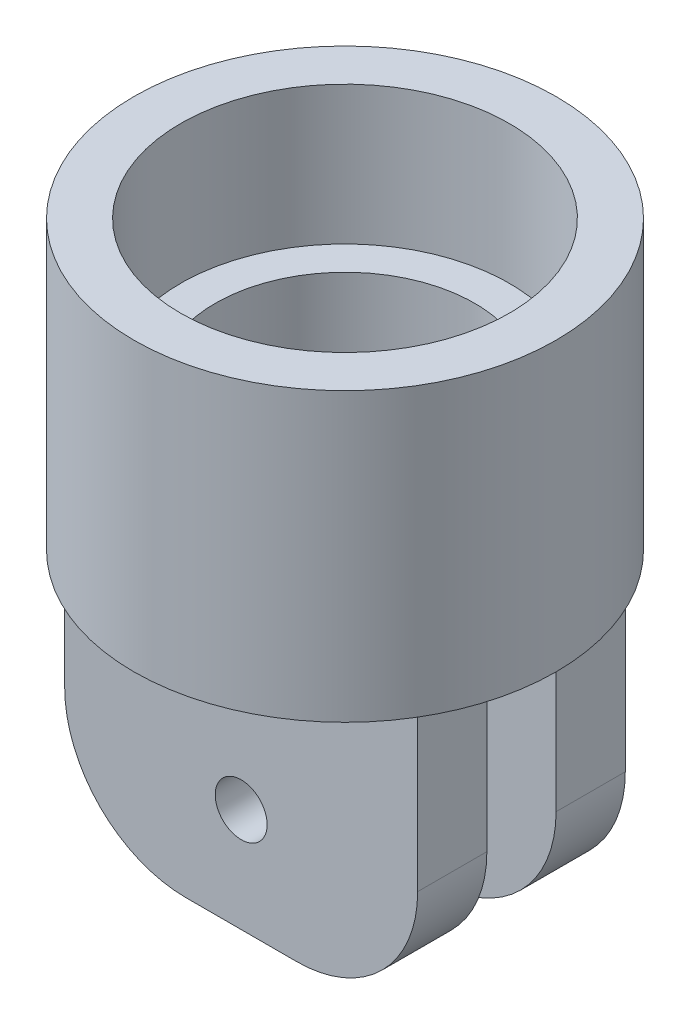
ISO-10303-21;
HEADER;
FILE_DESCRIPTION(('STEP AP214'),'2;1');
FILE_NAME('part.step','',(''),(''),'','','');
FILE_SCHEMA(('AUTOMOTIVE_DESIGN { 1 0 10303 214 1 1 1 1 }'));
ENDSEC;
DATA;
#1=APPLICATION_CONTEXT('core data for automotive mechanical design processes');
#2=APPLICATION_PROTOCOL_DEFINITION('international standard','automotive_design',2000,#1);
#3=PRODUCT_CONTEXT('',#1,'mechanical');
#4=PRODUCT('Part','Part','',(#3));
#5=PRODUCT_RELATED_PRODUCT_CATEGORY('part','',(#4));
#6=PRODUCT_DEFINITION_FORMATION('','',#4);
#7=PRODUCT_DEFINITION_CONTEXT('part definition',#1,'design');
#8=PRODUCT_DEFINITION('design','',#6,#7);
#9=PRODUCT_DEFINITION_SHAPE('','',#8);
#10=(LENGTH_UNIT() NAMED_UNIT(*) SI_UNIT(.MILLI.,.METRE.));
#11=(NAMED_UNIT(*) PLANE_ANGLE_UNIT() SI_UNIT($,.RADIAN.));
#12=(NAMED_UNIT(*) SI_UNIT($,.STERADIAN.) SOLID_ANGLE_UNIT());
#13=UNCERTAINTY_MEASURE_WITH_UNIT(LENGTH_MEASURE(1.E-05),#10,'distance_accuracy_value','');
#14=(GEOMETRIC_REPRESENTATION_CONTEXT(3) GLOBAL_UNCERTAINTY_ASSIGNED_CONTEXT((#13)) GLOBAL_UNIT_ASSIGNED_CONTEXT((#10,
#11,#12)) REPRESENTATION_CONTEXT('',''));
#15=CARTESIAN_POINT('',(0.,0.,0.));
#16=DIRECTION('',(0.,0.,1.));
#17=DIRECTION('',(1.,0.,0.));
#18=AXIS2_PLACEMENT_3D('',#15,#16,#17);
#19=CARTESIAN_POINT('',(-5.1,0.,3.));
#20=DIRECTION('',(0.,-1.,0.));
#21=DIRECTION('',(0.,0.,-1.));
#22=AXIS2_PLACEMENT_3D('',#19,#20,#21);
#23=PLANE('',#22);
#24=CARTESIAN_POINT('',(0.,0.,0.));
#25=DIRECTION('',(0.,1.,0.));
#26=DIRECTION('',(0.,0.,1.));
#27=AXIS2_PLACEMENT_3D('',#24,#25,#26);
#28=CIRCLE('',#27,1.5);
#29=CARTESIAN_POINT('',(-1.1180339887499,0.,1.));
#30=VERTEX_POINT('',#29);
#31=CARTESIAN_POINT('',(1.1180339887499,0.,1.));
#32=VERTEX_POINT('',#31);
#33=EDGE_CURVE('E162',#30,#32,#28,.T.);
#34=ORIENTED_EDGE('',*,*,#33,.T.);
#35=DIRECTION('',(-1.,0.,0.));
#36=VECTOR('',#35,1.);
#37=CARTESIAN_POINT('',(-7.62868564007539,0.,1.));
#38=LINE('',#37,#36);
#39=EDGE_CURVE('E142',#32,#30,#38,.T.);
#40=ORIENTED_EDGE('',*,*,#39,.T.);
#41=EDGE_LOOP('',(#34,#40));
#42=FACE_BOUND('',#41,.T.);
#43=ADVANCED_FACE('F39',(#42),#23,.F.);
#44=CARTESIAN_POINT('',(-5.1,0.,3.));
#45=DIRECTION('',(1.,0.,0.));
#46=DIRECTION('',(0.,1.,0.));
#47=AXIS2_PLACEMENT_3D('',#44,#45,#46);
#48=PLANE('',#47);
#49=DIRECTION('',(0.,0.,-1.));
#50=VECTOR('',#49,1.);
#51=CARTESIAN_POINT('',(-5.1,-4.49999999999998,3.));
#52=LINE('',#51,#50);
#53=CARTESIAN_POINT('',(-5.1,-4.5,-1.));
#54=VERTEX_POINT('',#53);
#55=CARTESIAN_POINT('',(-5.1,-4.49999999999998,-3.));
#56=VERTEX_POINT('',#55);
#57=EDGE_CURVE('E273',#54,#56,#52,.T.);
#58=ORIENTED_EDGE('',*,*,#57,.F.);
#59=DIRECTION('',(0.,1.,0.));
#60=VECTOR('',#59,1.);
#61=CARTESIAN_POINT('',(-5.1,0.,-1.));
#62=LINE('',#61,#60);
#63=CARTESIAN_POINT('',(-5.1,0.,-1.));
#64=VERTEX_POINT('',#63);
#65=EDGE_CURVE('E183',#54,#64,#62,.T.);
#66=ORIENTED_EDGE('',*,*,#65,.T.);
#67=DIRECTION('',(0.,0.,-1.));
#68=VECTOR('',#67,1.);
#69=CARTESIAN_POINT('',(-5.1,0.,3.));
#70=LINE('',#69,#68);
#71=CARTESIAN_POINT('',(-5.1,0.,-3.));
#72=VERTEX_POINT('',#71);
#73=EDGE_CURVE('E228',#64,#72,#70,.T.);
#74=ORIENTED_EDGE('',*,*,#73,.T.);
#75=DIRECTION('',(0.,-1.,0.));
#76=VECTOR('',#75,1.);
#77=CARTESIAN_POINT('',(-5.1,0.,-3.));
#78=LINE('',#77,#76);
#79=EDGE_CURVE('E204',#72,#56,#78,.T.);
#80=ORIENTED_EDGE('',*,*,#79,.T.);
#81=EDGE_LOOP('',(#58,#66,#74,#80));
#82=FACE_BOUND('',#81,.T.);
#83=ADVANCED_FACE('F310',(#82),#48,.F.);
#84=CARTESIAN_POINT('',(-1.6,-4.5,3.));
#85=DIRECTION('',(0.,0.,-1.));
#86=DIRECTION('',(-1.,0.,0.));
#87=AXIS2_PLACEMENT_3D('',#84,#85,#86);
#88=CYLINDRICAL_SURFACE('',#87,3.5);
#89=DIRECTION('',(0.,0.,-1.));
#90=VECTOR('',#89,1.);
#91=CARTESIAN_POINT('',(-1.59999999999997,-8.,3.));
#92=LINE('',#91,#90);
#93=CARTESIAN_POINT('',(-1.59999999999997,-8.,-1.));
#94=VERTEX_POINT('',#93);
#95=CARTESIAN_POINT('',(-1.59999999999997,-8.,-3.));
#96=VERTEX_POINT('',#95);
#97=EDGE_CURVE('E268',#94,#96,#92,.T.);
#98=ORIENTED_EDGE('',*,*,#97,.F.);
#99=CARTESIAN_POINT('',(-1.6,-4.5,-1.));
#100=DIRECTION('',(0.,0.,-1.));
#101=DIRECTION('',(-1.,0.,0.));
#102=AXIS2_PLACEMENT_3D('',#99,#100,#101);
#103=CIRCLE('',#102,3.5);
#104=EDGE_CURVE('E191',#94,#54,#103,.T.);
#105=ORIENTED_EDGE('',*,*,#104,.T.);
#106=ORIENTED_EDGE('',*,*,#57,.T.);
#107=CARTESIAN_POINT('',(-1.6,-4.5,-3.));
#108=DIRECTION('',(0.,0.,1.));
#109=DIRECTION('',(1.,0.,0.));
#110=AXIS2_PLACEMENT_3D('',#107,#108,#109);
#111=CIRCLE('',#110,3.5);
#112=EDGE_CURVE('E232',#56,#96,#111,.T.);
#113=ORIENTED_EDGE('',*,*,#112,.T.);
#114=EDGE_LOOP('',(#98,#105,#106,#113));
#115=FACE_BOUND('',#114,.T.);
#116=ADVANCED_FACE('F317',(#115),#88,.T.);
#117=CARTESIAN_POINT('',(-1.59999999999997,-8.,3.));
#118=DIRECTION('',(0.,1.,0.));
#119=DIRECTION('',(0.,0.,1.));
#120=AXIS2_PLACEMENT_3D('',#117,#118,#119);
#121=PLANE('',#120);
#122=DIRECTION('',(0.,0.,-1.));
#123=VECTOR('',#122,1.);
#124=CARTESIAN_POINT('',(1.59999999999998,-8.,3.));
#125=LINE('',#124,#123);
#126=CARTESIAN_POINT('',(1.6,-8.,-1.));
#127=VERTEX_POINT('',#126);
#128=CARTESIAN_POINT('',(1.59999999999998,-8.,-3.));
#129=VERTEX_POINT('',#128);
#130=EDGE_CURVE('E263',#127,#129,#125,.T.);
#131=ORIENTED_EDGE('',*,*,#130,.F.);
#132=DIRECTION('',(1.,0.,0.));
#133=VECTOR('',#132,1.);
#134=CARTESIAN_POINT('',(-7.62868564007539,-8.,-1.));
#135=LINE('',#134,#133);
#136=EDGE_CURVE('E342',#94,#127,#135,.T.);
#137=ORIENTED_EDGE('',*,*,#136,.F.);
#138=ORIENTED_EDGE('',*,*,#97,.T.);
#139=DIRECTION('',(1.,0.,0.));
#140=VECTOR('',#139,1.);
#141=CARTESIAN_POINT('',(-1.59999999999997,-8.,-3.));
#142=LINE('',#141,#140);
#143=EDGE_CURVE('E236',#96,#129,#142,.T.);
#144=ORIENTED_EDGE('',*,*,#143,.T.);
#145=EDGE_LOOP('',(#131,#137,#138,#144));
#146=FACE_BOUND('',#145,.T.);
#147=ADVANCED_FACE('F372',(#146),#121,.F.);
#148=CARTESIAN_POINT('',(1.6,-4.5,3.));
#149=DIRECTION('',(0.,0.,-1.));
#150=DIRECTION('',(-1.,0.,0.));
#151=AXIS2_PLACEMENT_3D('',#148,#149,#150);
#152=CYLINDRICAL_SURFACE('',#151,3.5);
#153=DIRECTION('',(0.,0.,-1.));
#154=VECTOR('',#153,1.);
#155=CARTESIAN_POINT('',(5.1,-4.49999999999998,3.));
#156=LINE('',#155,#154);
#157=CARTESIAN_POINT('',(5.1,-4.49999999999998,-1.));
#158=VERTEX_POINT('',#157);
#159=CARTESIAN_POINT('',(5.1,-4.49999999999998,-3.));
#160=VERTEX_POINT('',#159);
#161=EDGE_CURVE('E258',#158,#160,#156,.T.);
#162=ORIENTED_EDGE('',*,*,#161,.F.);
#163=CARTESIAN_POINT('',(1.6,-4.5,-1.));
#164=DIRECTION('',(0.,0.,-1.));
#165=DIRECTION('',(-1.,0.,0.));
#166=AXIS2_PLACEMENT_3D('',#163,#164,#165);
#167=CIRCLE('',#166,3.5);
#168=EDGE_CURVE('E198',#158,#127,#167,.T.);
#169=ORIENTED_EDGE('',*,*,#168,.T.);
#170=ORIENTED_EDGE('',*,*,#130,.T.);
#171=CARTESIAN_POINT('',(1.6,-4.5,-3.));
#172=DIRECTION('',(0.,0.,1.));
#173=DIRECTION('',(1.,0.,0.));
#174=AXIS2_PLACEMENT_3D('',#171,#172,#173);
#175=CIRCLE('',#174,3.5);
#176=EDGE_CURVE('E240',#129,#160,#175,.T.);
#177=ORIENTED_EDGE('',*,*,#176,.T.);
#178=EDGE_LOOP('',(#162,#169,#170,#177));
#179=FACE_BOUND('',#178,.T.);
#180=ADVANCED_FACE('F369',(#179),#152,.T.);
#181=CARTESIAN_POINT('',(5.1,0.,3.));
#182=DIRECTION('',(-1.,0.,0.));
#183=DIRECTION('',(0.,-1.,0.));
#184=AXIS2_PLACEMENT_3D('',#181,#182,#183);
#185=PLANE('',#184);
#186=DIRECTION('',(0.,0.,-1.));
#187=VECTOR('',#186,1.);
#188=CARTESIAN_POINT('',(5.1,0.,3.));
#189=LINE('',#188,#187);
#190=CARTESIAN_POINT('',(5.1,0.,-1.));
#191=VERTEX_POINT('',#190);
#192=CARTESIAN_POINT('',(5.1,0.,-3.));
#193=VERTEX_POINT('',#192);
#194=EDGE_CURVE('E255',#191,#193,#189,.T.);
#195=ORIENTED_EDGE('',*,*,#194,.F.);
#196=DIRECTION('',(0.,-1.,0.));
#197=VECTOR('',#196,1.);
#198=CARTESIAN_POINT('',(5.1,0.,-1.));
#199=LINE('',#198,#197);
#200=EDGE_CURVE('E361',#191,#158,#199,.T.);
#201=ORIENTED_EDGE('',*,*,#200,.T.);
#202=ORIENTED_EDGE('',*,*,#161,.T.);
#203=DIRECTION('',(0.,1.,0.));
#204=VECTOR('',#203,1.);
#205=CARTESIAN_POINT('',(5.1,0.,-3.));
#206=LINE('',#205,#204);
#207=EDGE_CURVE('E244',#160,#193,#206,.T.);
#208=ORIENTED_EDGE('',*,*,#207,.T.);
#209=EDGE_LOOP('',(#195,#201,#202,#208));
#210=FACE_BOUND('',#209,.T.);
#211=ADVANCED_FACE('F304',(#210),#185,.F.);
#212=CARTESIAN_POINT('',(0.,-5.,3.));
#213=DIRECTION('',(0.,0.,-1.));
#214=DIRECTION('',(-1.,0.,0.));
#215=AXIS2_PLACEMENT_3D('',#212,#213,#214);
#216=CYLINDRICAL_SURFACE('',#215,0.75);
#217=CARTESIAN_POINT('',(0.,-5.,-1.));
#218=DIRECTION('',(0.,0.,-1.));
#219=DIRECTION('',(-1.,0.,0.));
#220=AXIS2_PLACEMENT_3D('',#217,#218,#219);
#221=CIRCLE('',#220,0.75);
#222=CARTESIAN_POINT('',(-0.749999999999999,-5.,-1.));
#223=VERTEX_POINT('',#222);
#224=EDGE_CURVE('E43',#223,#223,#221,.T.);
#225=ORIENTED_EDGE('',*,*,#224,.F.);
#226=EDGE_LOOP('',(#225));
#227=FACE_BOUND('',#226,.T.);
#228=CARTESIAN_POINT('',(0.,-5.,-3.));
#229=DIRECTION('',(0.,0.,1.));
#230=DIRECTION('',(1.,0.,0.));
#231=AXIS2_PLACEMENT_3D('',#228,#229,#230);
#232=CIRCLE('',#231,0.75);
#233=CARTESIAN_POINT('',(0.750000000000001,-5.,-3.));
#234=VERTEX_POINT('',#233);
#235=EDGE_CURVE('E182',#234,#234,#232,.T.);
#236=ORIENTED_EDGE('',*,*,#235,.F.);
#237=EDGE_LOOP('',(#236));
#238=FACE_BOUND('',#237,.T.);
#239=ADVANCED_FACE('F296',(#227,#238),#216,.F.);
#240=CARTESIAN_POINT('',(0.,0.,0.));
#241=DIRECTION('',(0.,1.,0.));
#242=DIRECTION('',(0.,0.,1.));
#243=AXIS2_PLACEMENT_3D('',#240,#241,#242);
#244=PLANE('',#243);
#245=DIRECTION('',(1.,0.,0.));
#246=VECTOR('',#245,1.);
#247=CARTESIAN_POINT('',(-7.62868564007539,0.,-1.));
#248=LINE('',#247,#246);
#249=CARTESIAN_POINT('',(1.1180339887499,0.,-1.));
#250=VERTEX_POINT('',#249);
#251=EDGE_CURVE('E57',#250,#191,#248,.T.);
#252=ORIENTED_EDGE('',*,*,#251,.T.);
#253=ORIENTED_EDGE('',*,*,#194,.T.);
#254=DIRECTION('',(-1.,0.,0.));
#255=VECTOR('',#254,1.);
#256=CARTESIAN_POINT('',(-5.1,0.,-3.));
#257=LINE('',#256,#255);
#258=EDGE_CURVE('E211',#193,#72,#257,.T.);
#259=ORIENTED_EDGE('',*,*,#258,.T.);
#260=ORIENTED_EDGE('',*,*,#73,.F.);
#261=CARTESIAN_POINT('',(-1.1180339887499,0.,-1.));
#262=VERTEX_POINT('',#261);
#263=EDGE_CURVE('E336',#64,#262,#248,.T.);
#264=ORIENTED_EDGE('',*,*,#263,.T.);
#265=EDGE_CURVE('E174',#262,#30,#28,.T.);
#266=ORIENTED_EDGE('',*,*,#265,.T.);
#267=CARTESIAN_POINT('',(-5.1,0.,1.));
#268=VERTEX_POINT('',#267);
#269=EDGE_CURVE('E145',#30,#268,#38,.T.);
#270=ORIENTED_EDGE('',*,*,#269,.T.);
#271=CARTESIAN_POINT('',(-5.1,0.,3.));
#272=VERTEX_POINT('',#271);
#273=EDGE_CURVE('E251',#272,#268,#70,.T.);
#274=ORIENTED_EDGE('',*,*,#273,.F.);
#275=DIRECTION('',(-1.,0.,0.));
#276=VECTOR('',#275,1.);
#277=CARTESIAN_POINT('',(-5.1,0.,3.));
#278=LINE('',#277,#276);
#279=CARTESIAN_POINT('',(5.1,0.,3.));
#280=VERTEX_POINT('',#279);
#281=EDGE_CURVE('E224',#280,#272,#278,.T.);
#282=ORIENTED_EDGE('',*,*,#281,.F.);
#283=CARTESIAN_POINT('',(5.1,0.,1.));
#284=VERTEX_POINT('',#283);
#285=EDGE_CURVE('E159',#280,#284,#189,.T.);
#286=ORIENTED_EDGE('',*,*,#285,.T.);
#287=EDGE_CURVE('E65',#284,#32,#38,.T.);
#288=ORIENTED_EDGE('',*,*,#287,.T.);
#289=EDGE_CURVE('E156',#32,#250,#28,.T.);
#290=ORIENTED_EDGE('',*,*,#289,.T.);
#291=EDGE_LOOP('',(#252,#253,#259,#260,#264,#266,#270,#274,#282,#286,#288,#290));
#292=FACE_BOUND('',#291,.T.);
#293=CARTESIAN_POINT('',(0.,0.,0.));
#294=DIRECTION('',(0.,1.,0.));
#295=DIRECTION('',(0.,0.,1.));
#296=AXIS2_PLACEMENT_3D('',#293,#294,#295);
#297=CIRCLE('',#296,6.1);
#298=CARTESIAN_POINT('',(0.,0.,6.1));
#299=VERTEX_POINT('',#298);
#300=EDGE_CURVE('E49',#299,#299,#297,.T.);
#301=ORIENTED_EDGE('',*,*,#300,.F.);
#302=EDGE_LOOP('',(#301));
#303=FACE_BOUND('',#302,.T.);
#304=ADVANCED_FACE('F153',(#292,#303),#244,.F.);
#305=CARTESIAN_POINT('',(0.,8.3,0.));
#306=DIRECTION('',(0.,-1.,0.));
#307=DIRECTION('',(0.,0.,-1.));
#308=AXIS2_PLACEMENT_3D('',#305,#306,#307);
#309=CYLINDRICAL_SURFACE('',#308,6.1);
#310=CARTESIAN_POINT('',(0.,8.3,0.));
#311=DIRECTION('',(0.,1.,0.));
#312=DIRECTION('',(0.,0.,1.));
#313=AXIS2_PLACEMENT_3D('',#310,#311,#312);
#314=CIRCLE('',#313,6.1);
#315=CARTESIAN_POINT('',(0.,8.3,6.1));
#316=VERTEX_POINT('',#315);
#317=EDGE_CURVE('E11',#316,#316,#314,.T.);
#318=ORIENTED_EDGE('',*,*,#317,.F.);
#319=EDGE_LOOP('',(#318));
#320=FACE_BOUND('',#319,.T.);
#321=ORIENTED_EDGE('',*,*,#300,.T.);
#322=EDGE_LOOP('',(#321));
#323=FACE_BOUND('',#322,.T.);
#324=ADVANCED_FACE('F41',(#320,#323),#309,.T.);
#325=CARTESIAN_POINT('',(0.,8.3,0.));
#326=DIRECTION('',(0.,1.,0.));
#327=DIRECTION('',(0.,0.,1.));
#328=AXIS2_PLACEMENT_3D('',#325,#326,#327);
#329=PLANE('',#328);
#330=CARTESIAN_POINT('',(0.,8.3,0.));
#331=DIRECTION('',(0.,1.,0.));
#332=DIRECTION('',(0.,0.,1.));
#333=AXIS2_PLACEMENT_3D('',#330,#331,#332);
#334=CIRCLE('',#333,4.75);
#335=CARTESIAN_POINT('',(0.,8.3,4.75));
#336=VERTEX_POINT('',#335);
#337=EDGE_CURVE('E283',#336,#336,#334,.T.);
#338=ORIENTED_EDGE('',*,*,#337,.F.);
#339=EDGE_LOOP('',(#338));
#340=FACE_BOUND('',#339,.T.);
#341=ORIENTED_EDGE('',*,*,#317,.T.);
#342=EDGE_LOOP('',(#341));
#343=FACE_BOUND('',#342,.T.);
#344=ADVANCED_FACE('F302',(#340,#343),#329,.T.);
#345=CARTESIAN_POINT('',(0.,4.3,0.));
#346=DIRECTION('',(0.,1.,0.));
#347=DIRECTION('',(0.,0.,1.));
#348=AXIS2_PLACEMENT_3D('',#345,#346,#347);
#349=CYLINDRICAL_SURFACE('',#348,4.75);
#350=CARTESIAN_POINT('',(0.,4.3,0.));
#351=DIRECTION('',(0.,1.,0.));
#352=DIRECTION('',(0.,0.,1.));
#353=AXIS2_PLACEMENT_3D('',#350,#351,#352);
#354=CIRCLE('',#353,4.75);
#355=CARTESIAN_POINT('',(0.,4.3,4.75));
#356=VERTEX_POINT('',#355);
#357=EDGE_CURVE('E285',#356,#356,#354,.T.);
#358=ORIENTED_EDGE('',*,*,#357,.F.);
#359=EDGE_LOOP('',(#358));
#360=FACE_BOUND('',#359,.T.);
#361=ORIENTED_EDGE('',*,*,#337,.T.);
#362=EDGE_LOOP('',(#361));
#363=FACE_BOUND('',#362,.T.);
#364=ADVANCED_FACE('F442',(#360,#363),#349,.F.);
#365=CARTESIAN_POINT('',(0.,4.3,0.));
#366=DIRECTION('',(0.,1.,0.));
#367=DIRECTION('',(0.,0.,1.));
#368=AXIS2_PLACEMENT_3D('',#365,#366,#367);
#369=PLANE('',#368);
#370=CARTESIAN_POINT('',(0.,4.3,0.));
#371=DIRECTION('',(0.,1.,0.));
#372=DIRECTION('',(0.,0.,1.));
#373=AXIS2_PLACEMENT_3D('',#370,#371,#372);
#374=CIRCLE('',#373,3.75);
#375=CARTESIAN_POINT('',(0.,4.3,3.75));
#376=VERTEX_POINT('',#375);
#377=EDGE_CURVE('E173',#376,#376,#374,.T.);
#378=ORIENTED_EDGE('',*,*,#377,.F.);
#379=EDGE_LOOP('',(#378));
#380=FACE_BOUND('',#379,.T.);
#381=ORIENTED_EDGE('',*,*,#357,.T.);
#382=EDGE_LOOP('',(#381));
#383=FACE_BOUND('',#382,.T.);
#384=ADVANCED_FACE('F438',(#380,#383),#369,.T.);
#385=CARTESIAN_POINT('',(0.,0.8,0.));
#386=DIRECTION('',(0.,1.,0.));
#387=DIRECTION('',(0.,0.,1.));
#388=AXIS2_PLACEMENT_3D('',#385,#386,#387);
#389=CYLINDRICAL_SURFACE('',#388,3.75);
#390=CARTESIAN_POINT('',(0.,0.8,0.));
#391=DIRECTION('',(0.,1.,0.));
#392=DIRECTION('',(0.,0.,1.));
#393=AXIS2_PLACEMENT_3D('',#390,#391,#392);
#394=CIRCLE('',#393,3.75);
#395=CARTESIAN_POINT('',(0.,0.8,3.75));
#396=VERTEX_POINT('',#395);
#397=EDGE_CURVE('E178',#396,#396,#394,.T.);
#398=ORIENTED_EDGE('',*,*,#397,.F.);
#399=EDGE_LOOP('',(#398));
#400=FACE_BOUND('',#399,.T.);
#401=ORIENTED_EDGE('',*,*,#377,.T.);
#402=EDGE_LOOP('',(#401));
#403=FACE_BOUND('',#402,.T.);
#404=ADVANCED_FACE('F434',(#400,#403),#389,.F.);
#405=CARTESIAN_POINT('',(0.,0.8,0.));
#406=DIRECTION('',(0.,1.,0.));
#407=DIRECTION('',(0.,0.,1.));
#408=AXIS2_PLACEMENT_3D('',#405,#406,#407);
#409=PLANE('',#408);
#410=CARTESIAN_POINT('',(0.,0.8,0.));
#411=DIRECTION('',(0.,1.,0.));
#412=DIRECTION('',(0.,0.,1.));
#413=AXIS2_PLACEMENT_3D('',#410,#411,#412);
#414=CIRCLE('',#413,1.5);
#415=CARTESIAN_POINT('',(0.,0.8,1.5));
#416=VERTEX_POINT('',#415);
#417=EDGE_CURVE('E167',#416,#416,#414,.T.);
#418=ORIENTED_EDGE('',*,*,#417,.F.);
#419=EDGE_LOOP('',(#418));
#420=FACE_BOUND('',#419,.T.);
#421=ORIENTED_EDGE('',*,*,#397,.T.);
#422=EDGE_LOOP('',(#421));
#423=FACE_BOUND('',#422,.T.);
#424=ADVANCED_FACE('F331',(#420,#423),#409,.T.);
#425=CARTESIAN_POINT('',(0.,-3.2,0.));
#426=DIRECTION('',(0.,1.,0.));
#427=DIRECTION('',(0.,0.,1.));
#428=AXIS2_PLACEMENT_3D('',#425,#426,#427);
#429=CYLINDRICAL_SURFACE('',#428,1.5);
#430=ORIENTED_EDGE('',*,*,#417,.T.);
#431=EDGE_LOOP('',(#430));
#432=FACE_BOUND('',#431,.T.);
#433=ORIENTED_EDGE('',*,*,#289,.F.);
#434=ORIENTED_EDGE('',*,*,#33,.F.);
#435=ORIENTED_EDGE('',*,*,#265,.F.);
#436=EDGE_CURVE('E166',#250,#262,#28,.T.);
#437=ORIENTED_EDGE('',*,*,#436,.F.);
#438=EDGE_LOOP('',(#433,#434,#435,#437));
#439=FACE_BOUND('',#438,.T.);
#440=ADVANCED_FACE('F170',(#432,#439),#429,.F.);
#441=ORIENTED_EDGE('',*,*,#436,.T.);
#442=EDGE_CURVE('E334',#262,#250,#248,.T.);
#443=ORIENTED_EDGE('',*,*,#442,.T.);
#444=EDGE_LOOP('',(#441,#443));
#445=FACE_BOUND('',#444,.T.);
#446=ADVANCED_FACE('F312',(#445),#23,.F.);
#447=CARTESIAN_POINT('',(-1.6,-4.5,3.));
#448=DIRECTION('',(0.,0.,1.));
#449=DIRECTION('',(1.,0.,0.));
#450=AXIS2_PLACEMENT_3D('',#447,#448,#449);
#451=PLANE('',#450);
#452=DIRECTION('',(0.,-1.,0.));
#453=VECTOR('',#452,1.);
#454=CARTESIAN_POINT('',(-5.1,0.,3.));
#455=LINE('',#454,#453);
#456=CARTESIAN_POINT('',(-5.1,-4.49999999999998,3.));
#457=VERTEX_POINT('',#456);
#458=EDGE_CURVE('E206',#272,#457,#455,.T.);
#459=ORIENTED_EDGE('',*,*,#458,.T.);
#460=CARTESIAN_POINT('',(-1.6,-4.5,3.));
#461=DIRECTION('',(0.,0.,1.));
#462=DIRECTION('',(1.,0.,0.));
#463=AXIS2_PLACEMENT_3D('',#460,#461,#462);
#464=CIRCLE('',#463,3.5);
#465=CARTESIAN_POINT('',(-1.59999999999997,-8.,3.));
#466=VERTEX_POINT('',#465);
#467=EDGE_CURVE('E210',#457,#466,#464,.T.);
#468=ORIENTED_EDGE('',*,*,#467,.T.);
#469=DIRECTION('',(1.,0.,0.));
#470=VECTOR('',#469,1.);
#471=CARTESIAN_POINT('',(-1.59999999999997,-8.,3.));
#472=LINE('',#471,#470);
#473=CARTESIAN_POINT('',(1.59999999999998,-8.,3.));
#474=VERTEX_POINT('',#473);
#475=EDGE_CURVE('E214',#466,#474,#472,.T.);
#476=ORIENTED_EDGE('',*,*,#475,.T.);
#477=CARTESIAN_POINT('',(1.6,-4.5,3.));
#478=DIRECTION('',(0.,0.,1.));
#479=DIRECTION('',(1.,0.,0.));
#480=AXIS2_PLACEMENT_3D('',#477,#478,#479);
#481=CIRCLE('',#480,3.5);
#482=CARTESIAN_POINT('',(5.1,-4.49999999999998,3.));
#483=VERTEX_POINT('',#482);
#484=EDGE_CURVE('E217',#474,#483,#481,.T.);
#485=ORIENTED_EDGE('',*,*,#484,.T.);
#486=DIRECTION('',(0.,1.,0.));
#487=VECTOR('',#486,1.);
#488=CARTESIAN_POINT('',(5.1,0.,3.));
#489=LINE('',#488,#487);
#490=EDGE_CURVE('E220',#483,#280,#489,.T.);
#491=ORIENTED_EDGE('',*,*,#490,.T.);
#492=ORIENTED_EDGE('',*,*,#281,.T.);
#493=EDGE_LOOP('',(#459,#468,#476,#485,#491,#492));
#494=FACE_BOUND('',#493,.T.);
#495=CARTESIAN_POINT('',(0.,-5.,3.));
#496=DIRECTION('',(0.,0.,1.));
#497=DIRECTION('',(1.,0.,0.));
#498=AXIS2_PLACEMENT_3D('',#495,#496,#497);
#499=CIRCLE('',#498,0.75);
#500=CARTESIAN_POINT('',(0.750000000000001,-5.,3.));
#501=VERTEX_POINT('',#500);
#502=EDGE_CURVE('E188',#501,#501,#499,.T.);
#503=ORIENTED_EDGE('',*,*,#502,.F.);
#504=EDGE_LOOP('',(#503));
#505=FACE_BOUND('',#504,.T.);
#506=ADVANCED_FACE('F322',(#494,#505),#451,.T.);
#507=CARTESIAN_POINT('',(-1.6,-4.5,-3.));
#508=DIRECTION('',(0.,0.,1.));
#509=DIRECTION('',(1.,0.,0.));
#510=AXIS2_PLACEMENT_3D('',#507,#508,#509);
#511=PLANE('',#510);
#512=ORIENTED_EDGE('',*,*,#79,.F.);
#513=ORIENTED_EDGE('',*,*,#258,.F.);
#514=ORIENTED_EDGE('',*,*,#207,.F.);
#515=ORIENTED_EDGE('',*,*,#176,.F.);
#516=ORIENTED_EDGE('',*,*,#143,.F.);
#517=ORIENTED_EDGE('',*,*,#112,.F.);
#518=EDGE_LOOP('',(#512,#513,#514,#515,#516,#517));
#519=FACE_BOUND('',#518,.T.);
#520=ORIENTED_EDGE('',*,*,#235,.T.);
#521=EDGE_LOOP('',(#520));
#522=FACE_BOUND('',#521,.T.);
#523=ADVANCED_FACE('F327',(#519,#522),#511,.F.);
#524=ORIENTED_EDGE('',*,*,#273,.T.);
#525=DIRECTION('',(0.,-1.,0.));
#526=VECTOR('',#525,1.);
#527=CARTESIAN_POINT('',(-5.1,0.,1.));
#528=LINE('',#527,#526);
#529=CARTESIAN_POINT('',(-5.1,-4.49999999999998,1.));
#530=VERTEX_POINT('',#529);
#531=EDGE_CURVE('E357',#268,#530,#528,.T.);
#532=ORIENTED_EDGE('',*,*,#531,.T.);
#533=EDGE_CURVE('E274',#457,#530,#52,.T.);
#534=ORIENTED_EDGE('',*,*,#533,.F.);
#535=ORIENTED_EDGE('',*,*,#458,.F.);
#536=EDGE_LOOP('',(#524,#532,#534,#535));
#537=FACE_BOUND('',#536,.T.);
#538=ADVANCED_FACE('F319',(#537),#48,.F.);
#539=ORIENTED_EDGE('',*,*,#533,.T.);
#540=CARTESIAN_POINT('',(-1.6,-4.5,1.));
#541=DIRECTION('',(0.,0.,1.));
#542=DIRECTION('',(1.,0.,0.));
#543=AXIS2_PLACEMENT_3D('',#540,#541,#542);
#544=CIRCLE('',#543,3.5);
#545=CARTESIAN_POINT('',(-1.59999999999997,-8.,1.));
#546=VERTEX_POINT('',#545);
#547=EDGE_CURVE('E353',#530,#546,#544,.T.);
#548=ORIENTED_EDGE('',*,*,#547,.T.);
#549=EDGE_CURVE('E269',#466,#546,#92,.T.);
#550=ORIENTED_EDGE('',*,*,#549,.F.);
#551=ORIENTED_EDGE('',*,*,#467,.F.);
#552=EDGE_LOOP('',(#539,#548,#550,#551));
#553=FACE_BOUND('',#552,.T.);
#554=ADVANCED_FACE('F398',(#553),#88,.T.);
#555=ORIENTED_EDGE('',*,*,#549,.T.);
#556=DIRECTION('',(-1.,0.,0.));
#557=VECTOR('',#556,1.);
#558=CARTESIAN_POINT('',(-7.62868564007539,-8.,1.));
#559=LINE('',#558,#557);
#560=CARTESIAN_POINT('',(1.6,-8.,1.));
#561=VERTEX_POINT('',#560);
#562=EDGE_CURVE('E340',#561,#546,#559,.T.);
#563=ORIENTED_EDGE('',*,*,#562,.F.);
#564=EDGE_CURVE('E264',#474,#561,#125,.T.);
#565=ORIENTED_EDGE('',*,*,#564,.F.);
#566=ORIENTED_EDGE('',*,*,#475,.F.);
#567=EDGE_LOOP('',(#555,#563,#565,#566));
#568=FACE_BOUND('',#567,.T.);
#569=ADVANCED_FACE('F401',(#568),#121,.F.);
#570=ORIENTED_EDGE('',*,*,#564,.T.);
#571=CARTESIAN_POINT('',(1.6,-4.5,1.));
#572=DIRECTION('',(0.,0.,1.));
#573=DIRECTION('',(1.,0.,0.));
#574=AXIS2_PLACEMENT_3D('',#571,#572,#573);
#575=CIRCLE('',#574,3.5);
#576=CARTESIAN_POINT('',(5.1,-4.49999999999998,1.));
#577=VERTEX_POINT('',#576);
#578=EDGE_CURVE('E349',#561,#577,#575,.T.);
#579=ORIENTED_EDGE('',*,*,#578,.T.);
#580=EDGE_CURVE('E259',#483,#577,#156,.T.);
#581=ORIENTED_EDGE('',*,*,#580,.F.);
#582=ORIENTED_EDGE('',*,*,#484,.F.);
#583=EDGE_LOOP('',(#570,#579,#581,#582));
#584=FACE_BOUND('',#583,.T.);
#585=ADVANCED_FACE('F411',(#584),#152,.T.);
#586=ORIENTED_EDGE('',*,*,#580,.T.);
#587=DIRECTION('',(0.,1.,0.));
#588=VECTOR('',#587,1.);
#589=CARTESIAN_POINT('',(5.1,0.,1.));
#590=LINE('',#589,#588);
#591=EDGE_CURVE('E346',#577,#284,#590,.T.);
#592=ORIENTED_EDGE('',*,*,#591,.T.);
#593=ORIENTED_EDGE('',*,*,#285,.F.);
#594=ORIENTED_EDGE('',*,*,#490,.F.);
#595=EDGE_LOOP('',(#586,#592,#593,#594));
#596=FACE_BOUND('',#595,.T.);
#597=ADVANCED_FACE('F409',(#596),#185,.F.);
#598=CARTESIAN_POINT('',(0.,-5.,1.));
#599=DIRECTION('',(0.,0.,1.));
#600=DIRECTION('',(1.,0.,0.));
#601=AXIS2_PLACEMENT_3D('',#598,#599,#600);
#602=CIRCLE('',#601,0.75);
#603=CARTESIAN_POINT('',(0.750000000000001,-5.,1.));
#604=VERTEX_POINT('',#603);
#605=EDGE_CURVE('E161',#604,#604,#602,.T.);
#606=ORIENTED_EDGE('',*,*,#605,.F.);
#607=EDGE_LOOP('',(#606));
#608=FACE_BOUND('',#607,.T.);
#609=ORIENTED_EDGE('',*,*,#502,.T.);
#610=EDGE_LOOP('',(#609));
#611=FACE_BOUND('',#610,.T.);
#612=ADVANCED_FACE('F307',(#608,#611),#216,.F.);
#613=CARTESIAN_POINT('',(-7.62868564007539,15.8193754162552,-1.));
#614=DIRECTION('',(0.,0.,-1.));
#615=DIRECTION('',(-1.,0.,0.));
#616=AXIS2_PLACEMENT_3D('',#613,#614,#615);
#617=PLANE('',#616);
#618=ORIENTED_EDGE('',*,*,#224,.T.);
#619=EDGE_LOOP('',(#618));
#620=FACE_BOUND('',#619,.T.);
#621=ORIENTED_EDGE('',*,*,#104,.F.);
#622=ORIENTED_EDGE('',*,*,#136,.T.);
#623=ORIENTED_EDGE('',*,*,#168,.F.);
#624=ORIENTED_EDGE('',*,*,#200,.F.);
#625=ORIENTED_EDGE('',*,*,#251,.F.);
#626=ORIENTED_EDGE('',*,*,#442,.F.);
#627=ORIENTED_EDGE('',*,*,#263,.F.);
#628=ORIENTED_EDGE('',*,*,#65,.F.);
#629=EDGE_LOOP('',(#621,#622,#623,#624,#625,#626,#627,#628));
#630=FACE_BOUND('',#629,.T.);
#631=ADVANCED_FACE('F390',(#620,#630),#617,.F.);
#632=CARTESIAN_POINT('',(-7.62868564007539,15.8193754162552,1.));
#633=DIRECTION('',(0.,0.,1.));
#634=DIRECTION('',(1.,0.,0.));
#635=AXIS2_PLACEMENT_3D('',#632,#633,#634);
#636=PLANE('',#635);
#637=ORIENTED_EDGE('',*,*,#605,.T.);
#638=EDGE_LOOP('',(#637));
#639=FACE_BOUND('',#638,.T.);
#640=ORIENTED_EDGE('',*,*,#269,.F.);
#641=ORIENTED_EDGE('',*,*,#39,.F.);
#642=ORIENTED_EDGE('',*,*,#287,.F.);
#643=ORIENTED_EDGE('',*,*,#591,.F.);
#644=ORIENTED_EDGE('',*,*,#578,.F.);
#645=ORIENTED_EDGE('',*,*,#562,.T.);
#646=ORIENTED_EDGE('',*,*,#547,.F.);
#647=ORIENTED_EDGE('',*,*,#531,.F.);
#648=EDGE_LOOP('',(#640,#641,#642,#643,#644,#645,#646,#647));
#649=FACE_BOUND('',#648,.T.);
#650=ADVANCED_FACE('F143',(#639,#649),#636,.F.);
#651=CLOSED_SHELL('',(#43,#83,#116,#147,#180,#211,#239,#304,#324,#344,#364,#384,#404,#424,#440,
#446,#506,#523,#538,#554,#569,#585,#597,#612,#631,#650));
#652=MANIFOLD_SOLID_BREP('B2',#651);
#653=ADVANCED_BREP_SHAPE_REPRESENTATION('',(#18,#652),#14);
#654=SHAPE_DEFINITION_REPRESENTATION(#9,#653);
ENDSEC;
END-ISO-10303-21;
